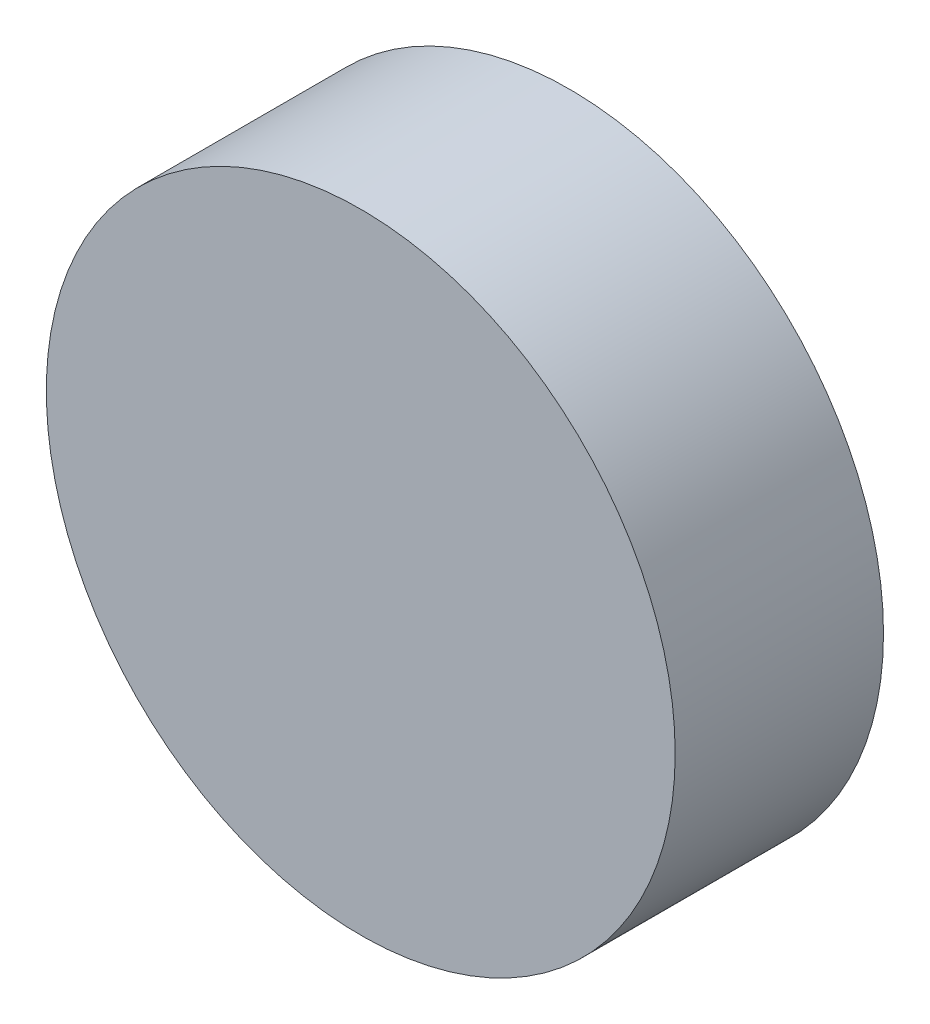
ISO-10303-21;
HEADER;
FILE_DESCRIPTION(('STEP AP214'),'2;1');
FILE_NAME('part.step','',(''),(''),'','','');
FILE_SCHEMA(('AUTOMOTIVE_DESIGN { 1 0 10303 214 1 1 1 1 }'));
ENDSEC;
DATA;
#1=APPLICATION_CONTEXT('core data for automotive mechanical design processes');
#2=APPLICATION_PROTOCOL_DEFINITION('international standard','automotive_design',2000,#1);
#3=PRODUCT_CONTEXT('',#1,'mechanical');
#4=PRODUCT('Part','Part','',(#3));
#5=PRODUCT_RELATED_PRODUCT_CATEGORY('part','',(#4));
#6=PRODUCT_DEFINITION_FORMATION('','',#4);
#7=PRODUCT_DEFINITION_CONTEXT('part definition',#1,'design');
#8=PRODUCT_DEFINITION('design','',#6,#7);
#9=PRODUCT_DEFINITION_SHAPE('','',#8);
#10=(LENGTH_UNIT() NAMED_UNIT(*) SI_UNIT(.MILLI.,.METRE.));
#11=(NAMED_UNIT(*) PLANE_ANGLE_UNIT() SI_UNIT($,.RADIAN.));
#12=(NAMED_UNIT(*) SI_UNIT($,.STERADIAN.) SOLID_ANGLE_UNIT());
#13=UNCERTAINTY_MEASURE_WITH_UNIT(LENGTH_MEASURE(1.E-05),#10,'distance_accuracy_value','');
#14=(GEOMETRIC_REPRESENTATION_CONTEXT(3) GLOBAL_UNCERTAINTY_ASSIGNED_CONTEXT((#13)) GLOBAL_UNIT_ASSIGNED_CONTEXT((#10,
#11,#12)) REPRESENTATION_CONTEXT('',''));
#15=CARTESIAN_POINT('',(0.,0.,0.));
#16=DIRECTION('',(0.,0.,1.));
#17=DIRECTION('',(1.,0.,0.));
#18=AXIS2_PLACEMENT_3D('',#15,#16,#17);
#19=CARTESIAN_POINT('',(0.,0.,2.65));
#20=DIRECTION('',(0.,0.,-1.));
#21=DIRECTION('',(-1.,0.,0.));
#22=AXIS2_PLACEMENT_3D('',#19,#20,#21);
#23=CYLINDRICAL_SURFACE('',#22,4.);
#24=CARTESIAN_POINT('',(0.,0.,2.65));
#25=DIRECTION('',(0.,0.,1.));
#26=DIRECTION('',(1.,0.,0.));
#27=AXIS2_PLACEMENT_3D('',#24,#25,#26);
#28=CIRCLE('',#27,4.);
#29=CARTESIAN_POINT('',(4.,0.,2.65));
#30=VERTEX_POINT('',#29);
#31=EDGE_CURVE('E10',#30,#30,#28,.T.);
#32=ORIENTED_EDGE('',*,*,#31,.F.);
#33=EDGE_LOOP('',(#32));
#34=FACE_BOUND('',#33,.T.);
#35=CARTESIAN_POINT('',(0.,0.,0.));
#36=DIRECTION('',(0.,0.,1.));
#37=DIRECTION('',(1.,0.,0.));
#38=AXIS2_PLACEMENT_3D('',#35,#36,#37);
#39=CIRCLE('',#38,4.);
#40=CARTESIAN_POINT('',(4.,0.,0.));
#41=VERTEX_POINT('',#40);
#42=EDGE_CURVE('E40',#41,#41,#39,.T.);
#43=ORIENTED_EDGE('',*,*,#42,.T.);
#44=EDGE_LOOP('',(#43));
#45=FACE_BOUND('',#44,.T.);
#46=ADVANCED_FACE('F37',(#34,#45),#23,.T.);
#47=CARTESIAN_POINT('',(0.,0.,2.65));
#48=DIRECTION('',(0.,0.,1.));
#49=DIRECTION('',(1.,0.,0.));
#50=AXIS2_PLACEMENT_3D('',#47,#48,#49);
#51=PLANE('',#50);
#52=ORIENTED_EDGE('',*,*,#31,.T.);
#53=EDGE_LOOP('',(#52));
#54=FACE_BOUND('',#53,.T.);
#55=ADVANCED_FACE('F54',(#54),#51,.T.);
#56=CARTESIAN_POINT('',(0.,0.,0.));
#57=DIRECTION('',(0.,0.,1.));
#58=DIRECTION('',(1.,0.,0.));
#59=AXIS2_PLACEMENT_3D('',#56,#57,#58);
#60=PLANE('',#59);
#61=ORIENTED_EDGE('',*,*,#42,.F.);
#62=EDGE_LOOP('',(#61));
#63=FACE_BOUND('',#62,.T.);
#64=ADVANCED_FACE('F52',(#63),#60,.F.);
#65=CLOSED_SHELL('',(#46,#55,#64));
#66=MANIFOLD_SOLID_BREP('B2',#65);
#67=ADVANCED_BREP_SHAPE_REPRESENTATION('',(#18,#66),#14);
#68=SHAPE_DEFINITION_REPRESENTATION(#9,#67);
ENDSEC;
END-ISO-10303-21;
